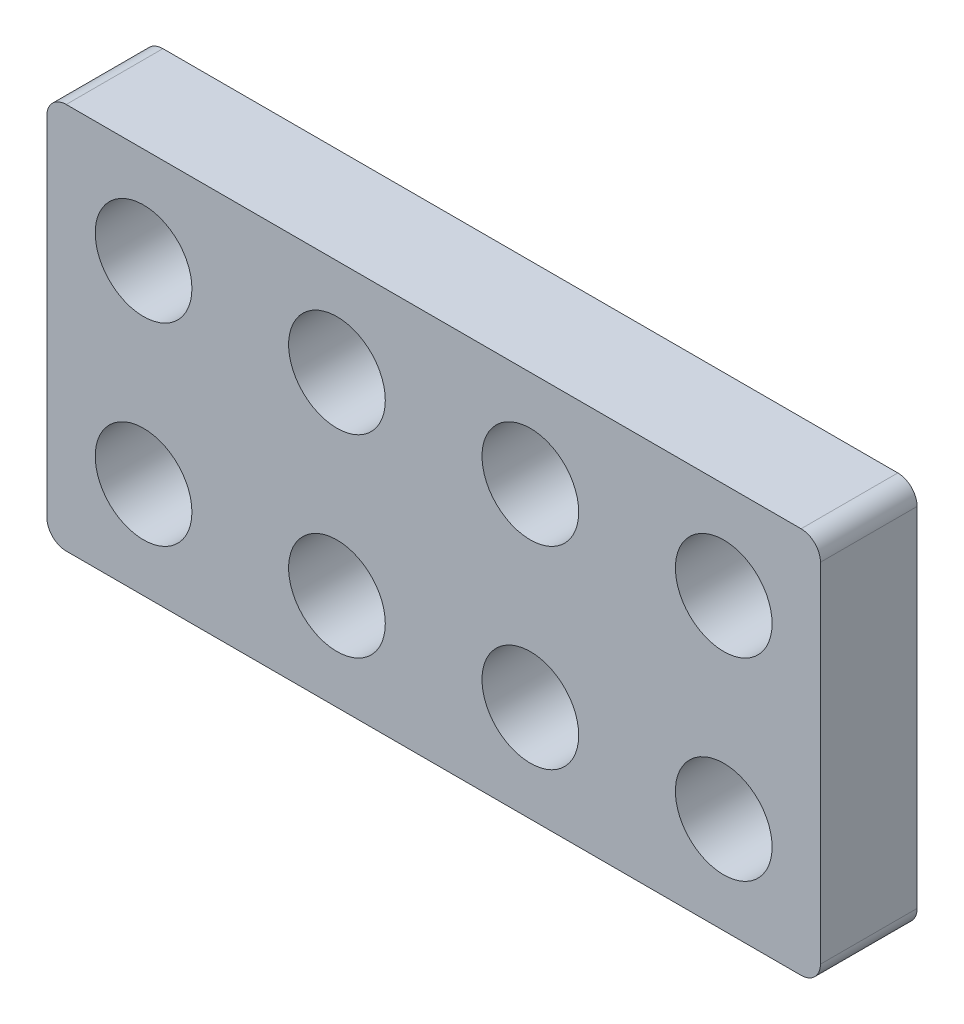
ISO-10303-21;
HEADER;
FILE_DESCRIPTION(('STEP AP214'),'2;1');
FILE_NAME('part.step','',(''),(''),'','','');
FILE_SCHEMA(('AUTOMOTIVE_DESIGN { 1 0 10303 214 1 1 1 1 }'));
ENDSEC;
DATA;
#1=APPLICATION_CONTEXT('core data for automotive mechanical design processes');
#2=APPLICATION_PROTOCOL_DEFINITION('international standard','automotive_design',2000,#1);
#3=PRODUCT_CONTEXT('',#1,'mechanical');
#4=PRODUCT('Part','Part','',(#3));
#5=PRODUCT_RELATED_PRODUCT_CATEGORY('part','',(#4));
#6=PRODUCT_DEFINITION_FORMATION('','',#4);
#7=PRODUCT_DEFINITION_CONTEXT('part definition',#1,'design');
#8=PRODUCT_DEFINITION('design','',#6,#7);
#9=PRODUCT_DEFINITION_SHAPE('','',#8);
#10=(LENGTH_UNIT() NAMED_UNIT(*) SI_UNIT(.MILLI.,.METRE.));
#11=(NAMED_UNIT(*) PLANE_ANGLE_UNIT() SI_UNIT($,.RADIAN.));
#12=(NAMED_UNIT(*) SI_UNIT($,.STERADIAN.) SOLID_ANGLE_UNIT());
#13=UNCERTAINTY_MEASURE_WITH_UNIT(LENGTH_MEASURE(1.E-05),#10,'distance_accuracy_value','');
#14=(GEOMETRIC_REPRESENTATION_CONTEXT(3) GLOBAL_UNCERTAINTY_ASSIGNED_CONTEXT((#13)) GLOBAL_UNIT_ASSIGNED_CONTEXT((#10,
#11,#12)) REPRESENTATION_CONTEXT('',''));
#15=CARTESIAN_POINT('',(0.,0.,0.));
#16=DIRECTION('',(0.,0.,1.));
#17=DIRECTION('',(1.,0.,0.));
#18=AXIS2_PLACEMENT_3D('',#15,#16,#17);
#19=CARTESIAN_POINT('',(70.,30.,0.));
#20=DIRECTION('',(0.,0.,1.));
#21=DIRECTION('',(1.,0.,0.));
#22=AXIS2_PLACEMENT_3D('',#19,#20,#21);
#23=CYLINDRICAL_SURFACE('',#22,5.);
#24=CARTESIAN_POINT('',(70.,30.,0.));
#25=DIRECTION('',(0.,0.,1.));
#26=DIRECTION('',(1.,0.,0.));
#27=AXIS2_PLACEMENT_3D('',#24,#25,#26);
#28=CIRCLE('',#27,5.);
#29=CARTESIAN_POINT('',(75.,30.,0.));
#30=VERTEX_POINT('',#29);
#31=EDGE_CURVE('E165',#30,#30,#28,.T.);
#32=ORIENTED_EDGE('',*,*,#31,.F.);
#33=EDGE_LOOP('',(#32));
#34=FACE_BOUND('',#33,.T.);
#35=CARTESIAN_POINT('',(70.,30.,10.));
#36=DIRECTION('',(0.,0.,1.));
#37=DIRECTION('',(1.,0.,0.));
#38=AXIS2_PLACEMENT_3D('',#35,#36,#37);
#39=CIRCLE('',#38,5.);
#40=CARTESIAN_POINT('',(75.,30.,10.));
#41=VERTEX_POINT('',#40);
#42=EDGE_CURVE('E168',#41,#41,#39,.T.);
#43=ORIENTED_EDGE('',*,*,#42,.T.);
#44=EDGE_LOOP('',(#43));
#45=FACE_BOUND('',#44,.T.);
#46=ADVANCED_FACE('F33',(#34,#45),#23,.F.);
#47=CARTESIAN_POINT('',(50.,30.,0.));
#48=DIRECTION('',(0.,0.,1.));
#49=DIRECTION('',(1.,0.,0.));
#50=AXIS2_PLACEMENT_3D('',#47,#48,#49);
#51=CYLINDRICAL_SURFACE('',#50,5.);
#52=CARTESIAN_POINT('',(50.,30.,0.));
#53=DIRECTION('',(0.,0.,1.));
#54=DIRECTION('',(1.,0.,0.));
#55=AXIS2_PLACEMENT_3D('',#52,#53,#54);
#56=CIRCLE('',#55,5.);
#57=CARTESIAN_POINT('',(55.,30.,0.));
#58=VERTEX_POINT('',#57);
#59=EDGE_CURVE('E159',#58,#58,#56,.T.);
#60=ORIENTED_EDGE('',*,*,#59,.F.);
#61=EDGE_LOOP('',(#60));
#62=FACE_BOUND('',#61,.T.);
#63=CARTESIAN_POINT('',(50.,30.,10.));
#64=DIRECTION('',(0.,0.,1.));
#65=DIRECTION('',(1.,0.,0.));
#66=AXIS2_PLACEMENT_3D('',#63,#64,#65);
#67=CIRCLE('',#66,5.);
#68=CARTESIAN_POINT('',(55.,30.,10.));
#69=VERTEX_POINT('',#68);
#70=EDGE_CURVE('E162',#69,#69,#67,.T.);
#71=ORIENTED_EDGE('',*,*,#70,.T.);
#72=EDGE_LOOP('',(#71));
#73=FACE_BOUND('',#72,.T.);
#74=ADVANCED_FACE('F249',(#62,#73),#51,.F.);
#75=CARTESIAN_POINT('',(30.,30.,0.));
#76=DIRECTION('',(0.,0.,1.));
#77=DIRECTION('',(1.,0.,0.));
#78=AXIS2_PLACEMENT_3D('',#75,#76,#77);
#79=CYLINDRICAL_SURFACE('',#78,5.);
#80=CARTESIAN_POINT('',(30.,30.,0.));
#81=DIRECTION('',(0.,0.,1.));
#82=DIRECTION('',(1.,0.,0.));
#83=AXIS2_PLACEMENT_3D('',#80,#81,#82);
#84=CIRCLE('',#83,5.);
#85=CARTESIAN_POINT('',(35.,30.,0.));
#86=VERTEX_POINT('',#85);
#87=EDGE_CURVE('E153',#86,#86,#84,.T.);
#88=ORIENTED_EDGE('',*,*,#87,.F.);
#89=EDGE_LOOP('',(#88));
#90=FACE_BOUND('',#89,.T.);
#91=CARTESIAN_POINT('',(30.,30.,10.));
#92=DIRECTION('',(0.,0.,1.));
#93=DIRECTION('',(1.,0.,0.));
#94=AXIS2_PLACEMENT_3D('',#91,#92,#93);
#95=CIRCLE('',#94,5.);
#96=CARTESIAN_POINT('',(35.,30.,10.));
#97=VERTEX_POINT('',#96);
#98=EDGE_CURVE('E156',#97,#97,#95,.T.);
#99=ORIENTED_EDGE('',*,*,#98,.T.);
#100=EDGE_LOOP('',(#99));
#101=FACE_BOUND('',#100,.T.);
#102=ADVANCED_FACE('F255',(#90,#101),#79,.F.);
#103=CARTESIAN_POINT('',(9.99999999999999,30.,0.));
#104=DIRECTION('',(0.,0.,1.));
#105=DIRECTION('',(1.,0.,0.));
#106=AXIS2_PLACEMENT_3D('',#103,#104,#105);
#107=CYLINDRICAL_SURFACE('',#106,5.);
#108=CARTESIAN_POINT('',(9.99999999999999,30.,0.));
#109=DIRECTION('',(0.,0.,1.));
#110=DIRECTION('',(1.,0.,0.));
#111=AXIS2_PLACEMENT_3D('',#108,#109,#110);
#112=CIRCLE('',#111,5.);
#113=CARTESIAN_POINT('',(15.,30.,0.));
#114=VERTEX_POINT('',#113);
#115=EDGE_CURVE('E147',#114,#114,#112,.T.);
#116=ORIENTED_EDGE('',*,*,#115,.F.);
#117=EDGE_LOOP('',(#116));
#118=FACE_BOUND('',#117,.T.);
#119=CARTESIAN_POINT('',(9.99999999999999,30.,10.));
#120=DIRECTION('',(0.,0.,1.));
#121=DIRECTION('',(1.,0.,0.));
#122=AXIS2_PLACEMENT_3D('',#119,#120,#121);
#123=CIRCLE('',#122,5.);
#124=CARTESIAN_POINT('',(15.,30.,10.));
#125=VERTEX_POINT('',#124);
#126=EDGE_CURVE('E150',#125,#125,#123,.T.);
#127=ORIENTED_EDGE('',*,*,#126,.T.);
#128=EDGE_LOOP('',(#127));
#129=FACE_BOUND('',#128,.T.);
#130=ADVANCED_FACE('F297',(#118,#129),#107,.F.);
#131=CARTESIAN_POINT('',(70.,10.,0.));
#132=DIRECTION('',(0.,0.,1.));
#133=DIRECTION('',(1.,0.,0.));
#134=AXIS2_PLACEMENT_3D('',#131,#132,#133);
#135=CYLINDRICAL_SURFACE('',#134,5.);
#136=CARTESIAN_POINT('',(70.,10.,0.));
#137=DIRECTION('',(0.,0.,1.));
#138=DIRECTION('',(1.,0.,0.));
#139=AXIS2_PLACEMENT_3D('',#136,#137,#138);
#140=CIRCLE('',#139,5.);
#141=CARTESIAN_POINT('',(75.,10.,0.));
#142=VERTEX_POINT('',#141);
#143=EDGE_CURVE('E141',#142,#142,#140,.T.);
#144=ORIENTED_EDGE('',*,*,#143,.F.);
#145=EDGE_LOOP('',(#144));
#146=FACE_BOUND('',#145,.T.);
#147=CARTESIAN_POINT('',(70.,10.,10.));
#148=DIRECTION('',(0.,0.,1.));
#149=DIRECTION('',(1.,0.,0.));
#150=AXIS2_PLACEMENT_3D('',#147,#148,#149);
#151=CIRCLE('',#150,5.);
#152=CARTESIAN_POINT('',(75.,10.,10.));
#153=VERTEX_POINT('',#152);
#154=EDGE_CURVE('E144',#153,#153,#151,.T.);
#155=ORIENTED_EDGE('',*,*,#154,.T.);
#156=EDGE_LOOP('',(#155));
#157=FACE_BOUND('',#156,.T.);
#158=ADVANCED_FACE('F293',(#146,#157),#135,.F.);
#159=CARTESIAN_POINT('',(50.,10.,0.));
#160=DIRECTION('',(0.,0.,1.));
#161=DIRECTION('',(1.,0.,0.));
#162=AXIS2_PLACEMENT_3D('',#159,#160,#161);
#163=CYLINDRICAL_SURFACE('',#162,5.);
#164=CARTESIAN_POINT('',(50.,10.,0.));
#165=DIRECTION('',(0.,0.,1.));
#166=DIRECTION('',(1.,0.,0.));
#167=AXIS2_PLACEMENT_3D('',#164,#165,#166);
#168=CIRCLE('',#167,5.);
#169=CARTESIAN_POINT('',(55.,10.,0.));
#170=VERTEX_POINT('',#169);
#171=EDGE_CURVE('E135',#170,#170,#168,.T.);
#172=ORIENTED_EDGE('',*,*,#171,.F.);
#173=EDGE_LOOP('',(#172));
#174=FACE_BOUND('',#173,.T.);
#175=CARTESIAN_POINT('',(50.,10.,10.));
#176=DIRECTION('',(0.,0.,1.));
#177=DIRECTION('',(1.,0.,0.));
#178=AXIS2_PLACEMENT_3D('',#175,#176,#177);
#179=CIRCLE('',#178,5.);
#180=CARTESIAN_POINT('',(55.,10.,10.));
#181=VERTEX_POINT('',#180);
#182=EDGE_CURVE('E138',#181,#181,#179,.T.);
#183=ORIENTED_EDGE('',*,*,#182,.T.);
#184=EDGE_LOOP('',(#183));
#185=FACE_BOUND('',#184,.T.);
#186=ADVANCED_FACE('F290',(#174,#185),#163,.F.);
#187=CARTESIAN_POINT('',(0.,0.,10.));
#188=DIRECTION('',(1.,0.,0.));
#189=DIRECTION('',(0.,1.,0.));
#190=AXIS2_PLACEMENT_3D('',#187,#188,#189);
#191=PLANE('',#190);
#192=DIRECTION('',(0.,-1.,0.));
#193=VECTOR('',#192,1.);
#194=CARTESIAN_POINT('',(0.,0.,0.));
#195=LINE('',#194,#193);
#196=CARTESIAN_POINT('',(0.,38.,0.));
#197=VERTEX_POINT('',#196);
#198=CARTESIAN_POINT('',(0.,2.,0.));
#199=VERTEX_POINT('',#198);
#200=EDGE_CURVE('E195',#197,#199,#195,.T.);
#201=ORIENTED_EDGE('',*,*,#200,.T.);
#202=DIRECTION('',(0.,0.,-1.));
#203=VECTOR('',#202,1.);
#204=CARTESIAN_POINT('',(0.,2.,10.));
#205=LINE('',#204,#203);
#206=CARTESIAN_POINT('',(0.,2.,10.));
#207=VERTEX_POINT('',#206);
#208=EDGE_CURVE('E11',#199,#207,#205,.F.);
#209=ORIENTED_EDGE('',*,*,#208,.T.);
#210=DIRECTION('',(0.,-1.,0.));
#211=VECTOR('',#210,1.);
#212=CARTESIAN_POINT('',(0.,0.,10.));
#213=LINE('',#212,#211);
#214=CARTESIAN_POINT('',(0.,38.,10.));
#215=VERTEX_POINT('',#214);
#216=EDGE_CURVE('E126',#215,#207,#213,.T.);
#217=ORIENTED_EDGE('',*,*,#216,.F.);
#218=DIRECTION('',(0.,0.,-1.));
#219=VECTOR('',#218,1.);
#220=CARTESIAN_POINT('',(0.,38.,10.));
#221=LINE('',#220,#219);
#222=EDGE_CURVE('E41',#215,#197,#221,.T.);
#223=ORIENTED_EDGE('',*,*,#222,.T.);
#224=EDGE_LOOP('',(#201,#209,#217,#223));
#225=FACE_BOUND('',#224,.T.);
#226=ADVANCED_FACE('F194',(#225),#191,.F.);
#227=CARTESIAN_POINT('',(0.,0.,10.));
#228=DIRECTION('',(0.,1.,0.));
#229=DIRECTION('',(0.,0.,1.));
#230=AXIS2_PLACEMENT_3D('',#227,#228,#229);
#231=PLANE('',#230);
#232=DIRECTION('',(1.,0.,0.));
#233=VECTOR('',#232,1.);
#234=CARTESIAN_POINT('',(0.,0.,0.));
#235=LINE('',#234,#233);
#236=CARTESIAN_POINT('',(2.,0.,0.));
#237=VERTEX_POINT('',#236);
#238=CARTESIAN_POINT('',(78.,0.,0.));
#239=VERTEX_POINT('',#238);
#240=EDGE_CURVE('E131',#237,#239,#235,.T.);
#241=ORIENTED_EDGE('',*,*,#240,.T.);
#242=DIRECTION('',(0.,0.,-1.));
#243=VECTOR('',#242,1.);
#244=CARTESIAN_POINT('',(78.,0.,10.));
#245=LINE('',#244,#243);
#246=CARTESIAN_POINT('',(78.,0.,10.));
#247=VERTEX_POINT('',#246);
#248=EDGE_CURVE('E48',#239,#247,#245,.F.);
#249=ORIENTED_EDGE('',*,*,#248,.T.);
#250=DIRECTION('',(1.,0.,0.));
#251=VECTOR('',#250,1.);
#252=CARTESIAN_POINT('',(0.,0.,10.));
#253=LINE('',#252,#251);
#254=CARTESIAN_POINT('',(2.,0.,10.));
#255=VERTEX_POINT('',#254);
#256=EDGE_CURVE('E129',#255,#247,#253,.T.);
#257=ORIENTED_EDGE('',*,*,#256,.F.);
#258=DIRECTION('',(0.,0.,-1.));
#259=VECTOR('',#258,1.);
#260=CARTESIAN_POINT('',(2.,0.,10.));
#261=LINE('',#260,#259);
#262=EDGE_CURVE('E186',#255,#237,#261,.T.);
#263=ORIENTED_EDGE('',*,*,#262,.T.);
#264=EDGE_LOOP('',(#241,#249,#257,#263));
#265=FACE_BOUND('',#264,.T.);
#266=ADVANCED_FACE('F273',(#265),#231,.F.);
#267=CARTESIAN_POINT('',(80.,0.,10.));
#268=DIRECTION('',(-1.,0.,0.));
#269=DIRECTION('',(0.,-1.,0.));
#270=AXIS2_PLACEMENT_3D('',#267,#268,#269);
#271=PLANE('',#270);
#272=DIRECTION('',(0.,1.,0.));
#273=VECTOR('',#272,1.);
#274=CARTESIAN_POINT('',(80.,0.,0.));
#275=LINE('',#274,#273);
#276=CARTESIAN_POINT('',(80.,2.,0.));
#277=VERTEX_POINT('',#276);
#278=CARTESIAN_POINT('',(80.,38.,0.));
#279=VERTEX_POINT('',#278);
#280=EDGE_CURVE('E127',#277,#279,#275,.T.);
#281=ORIENTED_EDGE('',*,*,#280,.T.);
#282=DIRECTION('',(0.,0.,-1.));
#283=VECTOR('',#282,1.);
#284=CARTESIAN_POINT('',(80.,38.,10.));
#285=LINE('',#284,#283);
#286=CARTESIAN_POINT('',(80.,38.,10.));
#287=VERTEX_POINT('',#286);
#288=EDGE_CURVE('E104',#279,#287,#285,.F.);
#289=ORIENTED_EDGE('',*,*,#288,.T.);
#290=DIRECTION('',(0.,1.,0.));
#291=VECTOR('',#290,1.);
#292=CARTESIAN_POINT('',(80.,0.,10.));
#293=LINE('',#292,#291);
#294=CARTESIAN_POINT('',(80.,2.,10.));
#295=VERTEX_POINT('',#294);
#296=EDGE_CURVE('E207',#295,#287,#293,.T.);
#297=ORIENTED_EDGE('',*,*,#296,.F.);
#298=DIRECTION('',(0.,0.,-1.));
#299=VECTOR('',#298,1.);
#300=CARTESIAN_POINT('',(80.,2.,10.));
#301=LINE('',#300,#299);
#302=EDGE_CURVE('E109',#295,#277,#301,.T.);
#303=ORIENTED_EDGE('',*,*,#302,.T.);
#304=EDGE_LOOP('',(#281,#289,#297,#303));
#305=FACE_BOUND('',#304,.T.);
#306=ADVANCED_FACE('F277',(#305),#271,.F.);
#307=CARTESIAN_POINT('',(0.,40.,10.));
#308=DIRECTION('',(0.,-1.,0.));
#309=DIRECTION('',(0.,0.,-1.));
#310=AXIS2_PLACEMENT_3D('',#307,#308,#309);
#311=PLANE('',#310);
#312=DIRECTION('',(-1.,0.,0.));
#313=VECTOR('',#312,1.);
#314=CARTESIAN_POINT('',(0.,40.,10.));
#315=LINE('',#314,#313);
#316=CARTESIAN_POINT('',(78.,40.,10.));
#317=VERTEX_POINT('',#316);
#318=CARTESIAN_POINT('',(1.99999999999999,40.,10.));
#319=VERTEX_POINT('',#318);
#320=EDGE_CURVE('E119',#317,#319,#315,.T.);
#321=ORIENTED_EDGE('',*,*,#320,.F.);
#322=DIRECTION('',(0.,0.,-1.));
#323=VECTOR('',#322,1.);
#324=CARTESIAN_POINT('',(78.,40.,10.));
#325=LINE('',#324,#323);
#326=CARTESIAN_POINT('',(78.,40.,0.));
#327=VERTEX_POINT('',#326);
#328=EDGE_CURVE('E103',#317,#327,#325,.T.);
#329=ORIENTED_EDGE('',*,*,#328,.T.);
#330=DIRECTION('',(-1.,0.,0.));
#331=VECTOR('',#330,1.);
#332=CARTESIAN_POINT('',(0.,40.,0.));
#333=LINE('',#332,#331);
#334=CARTESIAN_POINT('',(1.99999999999999,40.,0.));
#335=VERTEX_POINT('',#334);
#336=EDGE_CURVE('E116',#327,#335,#333,.T.);
#337=ORIENTED_EDGE('',*,*,#336,.T.);
#338=DIRECTION('',(0.,0.,-1.));
#339=VECTOR('',#338,1.);
#340=CARTESIAN_POINT('',(1.99999999999999,40.,10.));
#341=LINE('',#340,#339);
#342=EDGE_CURVE('E121',#335,#319,#341,.F.);
#343=ORIENTED_EDGE('',*,*,#342,.T.);
#344=EDGE_LOOP('',(#321,#329,#337,#343));
#345=FACE_BOUND('',#344,.T.);
#346=ADVANCED_FACE('F115',(#345),#311,.F.);
#347=CARTESIAN_POINT('',(0.,0.,10.));
#348=DIRECTION('',(0.,0.,-1.));
#349=DIRECTION('',(-1.,0.,0.));
#350=AXIS2_PLACEMENT_3D('',#347,#348,#349);
#351=PLANE('',#350);
#352=CARTESIAN_POINT('',(30.,10.,10.));
#353=DIRECTION('',(0.,0.,1.));
#354=DIRECTION('',(1.,0.,0.));
#355=AXIS2_PLACEMENT_3D('',#352,#353,#354);
#356=CIRCLE('',#355,5.);
#357=CARTESIAN_POINT('',(35.,10.,10.));
#358=VERTEX_POINT('',#357);
#359=EDGE_CURVE('E212',#358,#358,#356,.T.);
#360=ORIENTED_EDGE('',*,*,#359,.F.);
#361=EDGE_LOOP('',(#360));
#362=FACE_BOUND('',#361,.T.);
#363=CARTESIAN_POINT('',(10.,10.,10.));
#364=DIRECTION('',(0.,0.,1.));
#365=DIRECTION('',(1.,0.,0.));
#366=AXIS2_PLACEMENT_3D('',#363,#364,#365);
#367=CIRCLE('',#366,5.);
#368=CARTESIAN_POINT('',(15.,10.,10.));
#369=VERTEX_POINT('',#368);
#370=EDGE_CURVE('E203',#369,#369,#367,.T.);
#371=ORIENTED_EDGE('',*,*,#370,.F.);
#372=EDGE_LOOP('',(#371));
#373=FACE_BOUND('',#372,.T.);
#374=ORIENTED_EDGE('',*,*,#296,.T.);
#375=CARTESIAN_POINT('',(78.,38.,10.));
#376=DIRECTION('',(0.,0.,-1.));
#377=DIRECTION('',(-1.,0.,0.));
#378=AXIS2_PLACEMENT_3D('',#375,#376,#377);
#379=CIRCLE('',#378,2.);
#380=EDGE_CURVE('E184',#287,#317,#379,.F.);
#381=ORIENTED_EDGE('',*,*,#380,.T.);
#382=ORIENTED_EDGE('',*,*,#320,.T.);
#383=CARTESIAN_POINT('',(1.99999999999999,38.,10.));
#384=DIRECTION('',(0.,0.,-1.));
#385=DIRECTION('',(-1.,0.,0.));
#386=AXIS2_PLACEMENT_3D('',#383,#384,#385);
#387=CIRCLE('',#386,2.);
#388=EDGE_CURVE('E179',#319,#215,#387,.F.);
#389=ORIENTED_EDGE('',*,*,#388,.T.);
#390=ORIENTED_EDGE('',*,*,#216,.T.);
#391=CARTESIAN_POINT('',(2.,2.,10.));
#392=DIRECTION('',(0.,0.,-1.));
#393=DIRECTION('',(-1.,0.,0.));
#394=AXIS2_PLACEMENT_3D('',#391,#392,#393);
#395=CIRCLE('',#394,2.);
#396=EDGE_CURVE('E55',#207,#255,#395,.F.);
#397=ORIENTED_EDGE('',*,*,#396,.T.);
#398=ORIENTED_EDGE('',*,*,#256,.T.);
#399=CARTESIAN_POINT('',(78.,2.,10.));
#400=DIRECTION('',(0.,0.,-1.));
#401=DIRECTION('',(-1.,0.,0.));
#402=AXIS2_PLACEMENT_3D('',#399,#400,#401);
#403=CIRCLE('',#402,2.);
#404=EDGE_CURVE('E182',#247,#295,#403,.F.);
#405=ORIENTED_EDGE('',*,*,#404,.T.);
#406=EDGE_LOOP('',(#374,#381,#382,#389,#390,#397,#398,#405));
#407=FACE_BOUND('',#406,.T.);
#408=ORIENTED_EDGE('',*,*,#182,.F.);
#409=EDGE_LOOP('',(#408));
#410=FACE_BOUND('',#409,.T.);
#411=ORIENTED_EDGE('',*,*,#154,.F.);
#412=EDGE_LOOP('',(#411));
#413=FACE_BOUND('',#412,.T.);
#414=ORIENTED_EDGE('',*,*,#126,.F.);
#415=EDGE_LOOP('',(#414));
#416=FACE_BOUND('',#415,.T.);
#417=ORIENTED_EDGE('',*,*,#98,.F.);
#418=EDGE_LOOP('',(#417));
#419=FACE_BOUND('',#418,.T.);
#420=ORIENTED_EDGE('',*,*,#70,.F.);
#421=EDGE_LOOP('',(#420));
#422=FACE_BOUND('',#421,.T.);
#423=ORIENTED_EDGE('',*,*,#42,.F.);
#424=EDGE_LOOP('',(#423));
#425=FACE_BOUND('',#424,.T.);
#426=ADVANCED_FACE('F229',(#362,#373,#407,#410,#413,#416,#419,#422,#425),#351,.F.);
#427=CARTESIAN_POINT('',(0.,0.,0.));
#428=DIRECTION('',(0.,0.,-1.));
#429=DIRECTION('',(-1.,0.,0.));
#430=AXIS2_PLACEMENT_3D('',#427,#428,#429);
#431=PLANE('',#430);
#432=CARTESIAN_POINT('',(30.,10.,0.));
#433=DIRECTION('',(0.,0.,1.));
#434=DIRECTION('',(1.,0.,0.));
#435=AXIS2_PLACEMENT_3D('',#432,#433,#434);
#436=CIRCLE('',#435,5.);
#437=CARTESIAN_POINT('',(35.,10.,0.));
#438=VERTEX_POINT('',#437);
#439=EDGE_CURVE('E216',#438,#438,#436,.T.);
#440=ORIENTED_EDGE('',*,*,#439,.T.);
#441=EDGE_LOOP('',(#440));
#442=FACE_BOUND('',#441,.T.);
#443=CARTESIAN_POINT('',(10.,10.,0.));
#444=DIRECTION('',(0.,0.,1.));
#445=DIRECTION('',(1.,0.,0.));
#446=AXIS2_PLACEMENT_3D('',#443,#444,#445);
#447=CIRCLE('',#446,5.);
#448=CARTESIAN_POINT('',(15.,10.,0.));
#449=VERTEX_POINT('',#448);
#450=EDGE_CURVE('E200',#449,#449,#447,.T.);
#451=ORIENTED_EDGE('',*,*,#450,.T.);
#452=EDGE_LOOP('',(#451));
#453=FACE_BOUND('',#452,.T.);
#454=ORIENTED_EDGE('',*,*,#336,.F.);
#455=CARTESIAN_POINT('',(78.,38.,0.));
#456=DIRECTION('',(0.,0.,-1.));
#457=DIRECTION('',(-1.,0.,0.));
#458=AXIS2_PLACEMENT_3D('',#455,#456,#457);
#459=CIRCLE('',#458,2.);
#460=EDGE_CURVE('E99',#327,#279,#459,.T.);
#461=ORIENTED_EDGE('',*,*,#460,.T.);
#462=ORIENTED_EDGE('',*,*,#280,.F.);
#463=CARTESIAN_POINT('',(78.,2.,0.));
#464=DIRECTION('',(0.,0.,-1.));
#465=DIRECTION('',(-1.,0.,0.));
#466=AXIS2_PLACEMENT_3D('',#463,#464,#465);
#467=CIRCLE('',#466,2.);
#468=EDGE_CURVE('E110',#277,#239,#467,.T.);
#469=ORIENTED_EDGE('',*,*,#468,.T.);
#470=ORIENTED_EDGE('',*,*,#240,.F.);
#471=CARTESIAN_POINT('',(2.,2.,0.));
#472=DIRECTION('',(0.,0.,-1.));
#473=DIRECTION('',(-1.,0.,0.));
#474=AXIS2_PLACEMENT_3D('',#471,#472,#473);
#475=CIRCLE('',#474,2.);
#476=EDGE_CURVE('E173',#237,#199,#475,.T.);
#477=ORIENTED_EDGE('',*,*,#476,.T.);
#478=ORIENTED_EDGE('',*,*,#200,.F.);
#479=CARTESIAN_POINT('',(1.99999999999999,38.,0.));
#480=DIRECTION('',(0.,0.,-1.));
#481=DIRECTION('',(-1.,0.,0.));
#482=AXIS2_PLACEMENT_3D('',#479,#480,#481);
#483=CIRCLE('',#482,2.);
#484=EDGE_CURVE('E120',#197,#335,#483,.T.);
#485=ORIENTED_EDGE('',*,*,#484,.T.);
#486=EDGE_LOOP('',(#454,#461,#462,#469,#470,#477,#478,#485));
#487=FACE_BOUND('',#486,.T.);
#488=ORIENTED_EDGE('',*,*,#171,.T.);
#489=EDGE_LOOP('',(#488));
#490=FACE_BOUND('',#489,.T.);
#491=ORIENTED_EDGE('',*,*,#143,.T.);
#492=EDGE_LOOP('',(#491));
#493=FACE_BOUND('',#492,.T.);
#494=ORIENTED_EDGE('',*,*,#115,.T.);
#495=EDGE_LOOP('',(#494));
#496=FACE_BOUND('',#495,.T.);
#497=ORIENTED_EDGE('',*,*,#87,.T.);
#498=EDGE_LOOP('',(#497));
#499=FACE_BOUND('',#498,.T.);
#500=ORIENTED_EDGE('',*,*,#59,.T.);
#501=EDGE_LOOP('',(#500));
#502=FACE_BOUND('',#501,.T.);
#503=ORIENTED_EDGE('',*,*,#31,.T.);
#504=EDGE_LOOP('',(#503));
#505=FACE_BOUND('',#504,.T.);
#506=ADVANCED_FACE('F123',(#442,#453,#487,#490,#493,#496,#499,#502,#505),#431,.T.);
#507=CARTESIAN_POINT('',(10.,10.,0.));
#508=DIRECTION('',(0.,0.,1.));
#509=DIRECTION('',(1.,0.,0.));
#510=AXIS2_PLACEMENT_3D('',#507,#508,#509);
#511=CYLINDRICAL_SURFACE('',#510,5.);
#512=ORIENTED_EDGE('',*,*,#450,.F.);
#513=EDGE_LOOP('',(#512));
#514=FACE_BOUND('',#513,.T.);
#515=ORIENTED_EDGE('',*,*,#370,.T.);
#516=EDGE_LOOP('',(#515));
#517=FACE_BOUND('',#516,.T.);
#518=ADVANCED_FACE('F225',(#514,#517),#511,.F.);
#519=CARTESIAN_POINT('',(30.,10.,0.));
#520=DIRECTION('',(0.,0.,1.));
#521=DIRECTION('',(1.,0.,0.));
#522=AXIS2_PLACEMENT_3D('',#519,#520,#521);
#523=CYLINDRICAL_SURFACE('',#522,5.);
#524=ORIENTED_EDGE('',*,*,#439,.F.);
#525=EDGE_LOOP('',(#524));
#526=FACE_BOUND('',#525,.T.);
#527=ORIENTED_EDGE('',*,*,#359,.T.);
#528=EDGE_LOOP('',(#527));
#529=FACE_BOUND('',#528,.T.);
#530=ADVANCED_FACE('F222',(#526,#529),#523,.F.);
#531=CARTESIAN_POINT('',(78.,38.,10.));
#532=DIRECTION('',(0.,0.,-1.));
#533=DIRECTION('',(-1.,0.,0.));
#534=AXIS2_PLACEMENT_3D('',#531,#532,#533);
#535=CYLINDRICAL_SURFACE('',#534,2.);
#536=ORIENTED_EDGE('',*,*,#380,.F.);
#537=ORIENTED_EDGE('',*,*,#288,.F.);
#538=ORIENTED_EDGE('',*,*,#460,.F.);
#539=ORIENTED_EDGE('',*,*,#328,.F.);
#540=EDGE_LOOP('',(#536,#537,#538,#539));
#541=FACE_BOUND('',#540,.T.);
#542=ADVANCED_FACE('F102',(#541),#535,.T.);
#543=CARTESIAN_POINT('',(78.,2.,10.));
#544=DIRECTION('',(0.,0.,-1.));
#545=DIRECTION('',(-1.,0.,0.));
#546=AXIS2_PLACEMENT_3D('',#543,#544,#545);
#547=CYLINDRICAL_SURFACE('',#546,2.);
#548=ORIENTED_EDGE('',*,*,#404,.F.);
#549=ORIENTED_EDGE('',*,*,#248,.F.);
#550=ORIENTED_EDGE('',*,*,#468,.F.);
#551=ORIENTED_EDGE('',*,*,#302,.F.);
#552=EDGE_LOOP('',(#548,#549,#550,#551));
#553=FACE_BOUND('',#552,.T.);
#554=ADVANCED_FACE('F263',(#553),#547,.T.);
#555=CARTESIAN_POINT('',(2.,2.,10.));
#556=DIRECTION('',(0.,0.,-1.));
#557=DIRECTION('',(-1.,0.,0.));
#558=AXIS2_PLACEMENT_3D('',#555,#556,#557);
#559=CYLINDRICAL_SURFACE('',#558,2.);
#560=ORIENTED_EDGE('',*,*,#396,.F.);
#561=ORIENTED_EDGE('',*,*,#208,.F.);
#562=ORIENTED_EDGE('',*,*,#476,.F.);
#563=ORIENTED_EDGE('',*,*,#262,.F.);
#564=EDGE_LOOP('',(#560,#561,#562,#563));
#565=FACE_BOUND('',#564,.T.);
#566=ADVANCED_FACE('F265',(#565),#559,.T.);
#567=CARTESIAN_POINT('',(1.99999999999999,38.,10.));
#568=DIRECTION('',(0.,0.,-1.));
#569=DIRECTION('',(-1.,0.,0.));
#570=AXIS2_PLACEMENT_3D('',#567,#568,#569);
#571=CYLINDRICAL_SURFACE('',#570,2.);
#572=ORIENTED_EDGE('',*,*,#388,.F.);
#573=ORIENTED_EDGE('',*,*,#342,.F.);
#574=ORIENTED_EDGE('',*,*,#484,.F.);
#575=ORIENTED_EDGE('',*,*,#222,.F.);
#576=EDGE_LOOP('',(#572,#573,#574,#575));
#577=FACE_BOUND('',#576,.T.);
#578=ADVANCED_FACE('F35',(#577),#571,.T.);
#579=CLOSED_SHELL('',(#46,#74,#102,#130,#158,#186,#226,#266,#306,#346,#426,#506,#518,#530,#542,
#554,#566,#578));
#580=MANIFOLD_SOLID_BREP('B2',#579);
#581=ADVANCED_BREP_SHAPE_REPRESENTATION('',(#18,#580),#14);
#582=SHAPE_DEFINITION_REPRESENTATION(#9,#581);
ENDSEC;
END-ISO-10303-21;
